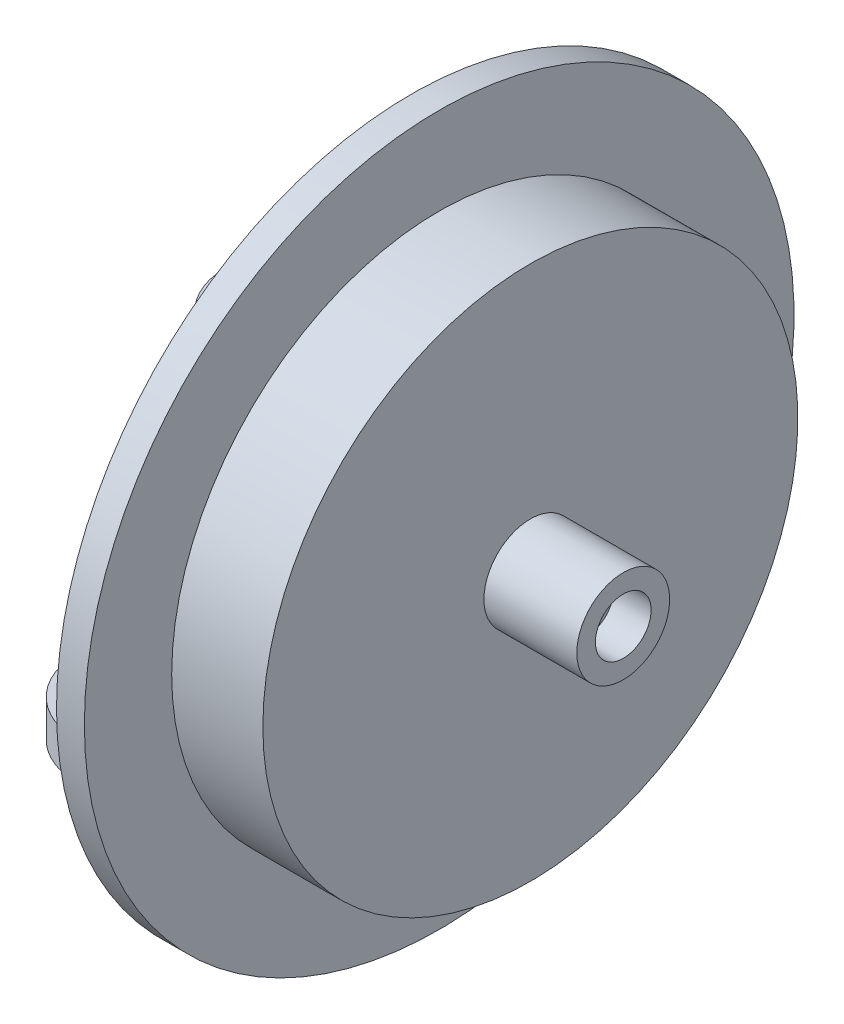
ISO-10303-21;
HEADER;
FILE_DESCRIPTION(('STEP AP214'),'2;1');
FILE_NAME('part.step','',(''),(''),'','','');
FILE_SCHEMA(('AUTOMOTIVE_DESIGN { 1 0 10303 214 1 1 1 1 }'));
ENDSEC;
DATA;
#1=APPLICATION_CONTEXT('core data for automotive mechanical design processes');
#2=APPLICATION_PROTOCOL_DEFINITION('international standard','automotive_design',2000,#1);
#3=PRODUCT_CONTEXT('',#1,'mechanical');
#4=PRODUCT('Part','Part','',(#3));
#5=PRODUCT_RELATED_PRODUCT_CATEGORY('part','',(#4));
#6=PRODUCT_DEFINITION_FORMATION('','',#4);
#7=PRODUCT_DEFINITION_CONTEXT('part definition',#1,'design');
#8=PRODUCT_DEFINITION('design','',#6,#7);
#9=PRODUCT_DEFINITION_SHAPE('','',#8);
#10=(LENGTH_UNIT() NAMED_UNIT(*) SI_UNIT(.MILLI.,.METRE.));
#11=(NAMED_UNIT(*) PLANE_ANGLE_UNIT() SI_UNIT($,.RADIAN.));
#12=(NAMED_UNIT(*) SI_UNIT($,.STERADIAN.) SOLID_ANGLE_UNIT());
#13=UNCERTAINTY_MEASURE_WITH_UNIT(LENGTH_MEASURE(1.E-05),#10,'distance_accuracy_value','');
#14=(GEOMETRIC_REPRESENTATION_CONTEXT(3) GLOBAL_UNCERTAINTY_ASSIGNED_CONTEXT((#13)) GLOBAL_UNIT_ASSIGNED_CONTEXT((#10,
#11,#12)) REPRESENTATION_CONTEXT('',''));
#15=CARTESIAN_POINT('',(0.,0.,0.));
#16=DIRECTION('',(0.,0.,1.));
#17=DIRECTION('',(1.,0.,0.));
#18=AXIS2_PLACEMENT_3D('',#15,#16,#17);
#19=CARTESIAN_POINT('',(-6.4079849746559,0.,-19.1));
#20=DIRECTION('',(1.,0.,0.));
#21=DIRECTION('',(0.,0.,-1.));
#22=AXIS2_PLACEMENT_3D('',#19,#20,#21);
#23=PLANE('',#22);
#24=CARTESIAN_POINT('',(-6.4079849746559,0.,0.));
#25=DIRECTION('',(-1.,0.,0.));
#26=DIRECTION('',(0.,0.,1.));
#27=AXIS2_PLACEMENT_3D('',#24,#25,#26);
#28=CIRCLE('',#27,19.1);
#29=CARTESIAN_POINT('',(-6.4079849746559,0.,19.1));
#30=VERTEX_POINT('',#29);
#31=EDGE_CURVE('E283',#30,#30,#28,.T.);
#32=ORIENTED_EDGE('',*,*,#31,.T.);
#33=EDGE_LOOP('',(#32));
#34=FACE_BOUND('',#33,.T.);
#35=CARTESIAN_POINT('',(-6.4079849746559,0.,0.));
#36=DIRECTION('',(-1.,0.,0.));
#37=DIRECTION('',(0.,0.,1.));
#38=AXIS2_PLACEMENT_3D('',#35,#36,#37);
#39=CIRCLE('',#38,1.);
#40=CARTESIAN_POINT('',(-6.4079849746559,0.,1.));
#41=VERTEX_POINT('',#40);
#42=EDGE_CURVE('E279',#41,#41,#39,.T.);
#43=ORIENTED_EDGE('',*,*,#42,.F.);
#44=EDGE_LOOP('',(#43));
#45=FACE_BOUND('',#44,.T.);
#46=DIRECTION('',(0.,-1.,0.));
#47=VECTOR('',#46,1.);
#48=CARTESIAN_POINT('',(-6.4079849746559,6.,-4.));
#49=LINE('',#48,#47);
#50=CARTESIAN_POINT('',(-6.4079849746559,6.,-4.));
#51=VERTEX_POINT('',#50);
#52=CARTESIAN_POINT('',(-6.4079849746559,4.,-4.));
#53=VERTEX_POINT('',#52);
#54=EDGE_CURVE('E242',#51,#53,#49,.T.);
#55=ORIENTED_EDGE('',*,*,#54,.F.);
#56=DIRECTION('',(0.,0.,-1.));
#57=VECTOR('',#56,1.);
#58=CARTESIAN_POINT('',(-6.4079849746559,6.,-4.));
#59=LINE('',#58,#57);
#60=CARTESIAN_POINT('',(-6.4079849746559,6.,4.));
#61=VERTEX_POINT('',#60);
#62=EDGE_CURVE('E254',#61,#51,#59,.T.);
#63=ORIENTED_EDGE('',*,*,#62,.F.);
#64=DIRECTION('',(0.,1.,0.));
#65=VECTOR('',#64,1.);
#66=CARTESIAN_POINT('',(-6.4079849746559,6.,4.));
#67=LINE('',#66,#65);
#68=CARTESIAN_POINT('',(-6.4079849746559,4.,4.));
#69=VERTEX_POINT('',#68);
#70=EDGE_CURVE('E250',#69,#61,#67,.T.);
#71=ORIENTED_EDGE('',*,*,#70,.F.);
#72=DIRECTION('',(0.,0.,1.));
#73=VECTOR('',#72,1.);
#74=CARTESIAN_POINT('',(-6.4079849746559,4.,-4.));
#75=LINE('',#74,#73);
#76=EDGE_CURVE('E246',#53,#69,#75,.T.);
#77=ORIENTED_EDGE('',*,*,#76,.F.);
#78=EDGE_LOOP('',(#55,#63,#71,#77));
#79=FACE_BOUND('',#78,.T.);
#80=DIRECTION('',(0.,0.,-1.));
#81=VECTOR('',#80,1.);
#82=CARTESIAN_POINT('',(-6.4079849746559,-4.,-4.));
#83=LINE('',#82,#81);
#84=CARTESIAN_POINT('',(-6.4079849746559,-4.,16.));
#85=VERTEX_POINT('',#84);
#86=CARTESIAN_POINT('',(-6.4079849746559,-4.,-4.));
#87=VERTEX_POINT('',#86);
#88=EDGE_CURVE('E232',#85,#87,#83,.T.);
#89=ORIENTED_EDGE('',*,*,#88,.F.);
#90=DIRECTION('',(0.,1.,0.));
#91=VECTOR('',#90,1.);
#92=CARTESIAN_POINT('',(-6.4079849746559,-6.,16.));
#93=LINE('',#92,#91);
#94=CARTESIAN_POINT('',(-6.4079849746559,-6.,16.));
#95=VERTEX_POINT('',#94);
#96=EDGE_CURVE('E208',#95,#85,#93,.T.);
#97=ORIENTED_EDGE('',*,*,#96,.F.);
#98=DIRECTION('',(0.,0.,1.));
#99=VECTOR('',#98,1.);
#100=CARTESIAN_POINT('',(-6.4079849746559,-6.,-4.));
#101=LINE('',#100,#99);
#102=CARTESIAN_POINT('',(-6.4079849746559,-6.,-4.));
#103=VERTEX_POINT('',#102);
#104=EDGE_CURVE('E203',#103,#95,#101,.T.);
#105=ORIENTED_EDGE('',*,*,#104,.F.);
#106=DIRECTION('',(0.,-1.,0.));
#107=VECTOR('',#106,1.);
#108=CARTESIAN_POINT('',(-6.4079849746559,-4.,-4.));
#109=LINE('',#108,#107);
#110=EDGE_CURVE('E226',#87,#103,#109,.T.);
#111=ORIENTED_EDGE('',*,*,#110,.F.);
#112=EDGE_LOOP('',(#89,#97,#105,#111));
#113=FACE_BOUND('',#112,.T.);
#114=ADVANCED_FACE('F39',(#34,#45,#79,#113),#23,.F.);
#115=CARTESIAN_POINT('',(5.,0.,0.));
#116=DIRECTION('',(-1.,0.,0.));
#117=DIRECTION('',(0.,0.,1.));
#118=AXIS2_PLACEMENT_3D('',#115,#116,#117);
#119=CYLINDRICAL_SURFACE('',#118,1.);
#120=ORIENTED_EDGE('',*,*,#42,.T.);
#121=EDGE_LOOP('',(#120));
#122=FACE_BOUND('',#121,.T.);
#123=CARTESIAN_POINT('',(3.,0.,0.));
#124=DIRECTION('',(1.,0.,0.));
#125=DIRECTION('',(0.,0.,-1.));
#126=AXIS2_PLACEMENT_3D('',#123,#124,#125);
#127=CIRCLE('',#126,1.);
#128=CARTESIAN_POINT('',(3.,0.,-1.));
#129=VERTEX_POINT('',#128);
#130=EDGE_CURVE('E275',#129,#129,#127,.F.);
#131=ORIENTED_EDGE('',*,*,#130,.F.);
#132=EDGE_LOOP('',(#131));
#133=FACE_BOUND('',#132,.T.);
#134=ADVANCED_FACE('F360',(#122,#133),#119,.F.);
#135=CARTESIAN_POINT('',(5.,0.,-2.5));
#136=DIRECTION('',(-1.,0.,0.));
#137=DIRECTION('',(0.,0.,1.));
#138=AXIS2_PLACEMENT_3D('',#135,#136,#137);
#139=PLANE('',#138);
#140=CARTESIAN_POINT('',(5.,0.,0.));
#141=DIRECTION('',(1.,0.,0.));
#142=DIRECTION('',(0.,0.,-1.));
#143=AXIS2_PLACEMENT_3D('',#140,#141,#142);
#144=CIRCLE('',#143,1.5);
#145=CARTESIAN_POINT('',(5.,0.,-1.5));
#146=VERTEX_POINT('',#145);
#147=EDGE_CURVE('E270',#146,#146,#144,.T.);
#148=ORIENTED_EDGE('',*,*,#147,.F.);
#149=EDGE_LOOP('',(#148));
#150=FACE_BOUND('',#149,.T.);
#151=CARTESIAN_POINT('',(5.,0.,0.));
#152=DIRECTION('',(-1.,0.,0.));
#153=DIRECTION('',(0.,0.,1.));
#154=AXIS2_PLACEMENT_3D('',#151,#152,#153);
#155=CIRCLE('',#154,2.5);
#156=CARTESIAN_POINT('',(5.,0.,2.5));
#157=VERTEX_POINT('',#156);
#158=EDGE_CURVE('E303',#157,#157,#155,.T.);
#159=ORIENTED_EDGE('',*,*,#158,.F.);
#160=EDGE_LOOP('',(#159));
#161=FACE_BOUND('',#160,.T.);
#162=ADVANCED_FACE('F366',(#150,#161),#139,.F.);
#163=CARTESIAN_POINT('',(-25.5271147425751,0.,0.));
#164=DIRECTION('',(-1.,0.,0.));
#165=DIRECTION('',(0.,0.,1.));
#166=AXIS2_PLACEMENT_3D('',#163,#164,#165);
#167=CYLINDRICAL_SURFACE('',#166,2.5);
#168=CARTESIAN_POINT('',(0.,0.,0.));
#169=DIRECTION('',(-1.,0.,0.));
#170=DIRECTION('',(0.,0.,1.));
#171=AXIS2_PLACEMENT_3D('',#168,#169,#170);
#172=CIRCLE('',#171,2.5);
#173=CARTESIAN_POINT('',(0.,0.,2.5));
#174=VERTEX_POINT('',#173);
#175=EDGE_CURVE('E299',#174,#174,#172,.T.);
#176=ORIENTED_EDGE('',*,*,#175,.F.);
#177=EDGE_LOOP('',(#176));
#178=FACE_BOUND('',#177,.T.);
#179=ORIENTED_EDGE('',*,*,#158,.T.);
#180=EDGE_LOOP('',(#179));
#181=FACE_BOUND('',#180,.T.);
#182=ADVANCED_FACE('F388',(#178,#181),#167,.T.);
#183=CARTESIAN_POINT('',(0.,0.,-2.5));
#184=DIRECTION('',(-1.,0.,0.));
#185=DIRECTION('',(0.,0.,1.));
#186=AXIS2_PLACEMENT_3D('',#183,#184,#185);
#187=PLANE('',#186);
#188=CARTESIAN_POINT('',(0.,0.,0.));
#189=DIRECTION('',(-1.,0.,0.));
#190=DIRECTION('',(0.,0.,1.));
#191=AXIS2_PLACEMENT_3D('',#188,#189,#190);
#192=CIRCLE('',#191,14.4);
#193=CARTESIAN_POINT('',(0.,0.,14.4));
#194=VERTEX_POINT('',#193);
#195=EDGE_CURVE('E295',#194,#194,#192,.T.);
#196=ORIENTED_EDGE('',*,*,#195,.F.);
#197=EDGE_LOOP('',(#196));
#198=FACE_BOUND('',#197,.T.);
#199=ORIENTED_EDGE('',*,*,#175,.T.);
#200=EDGE_LOOP('',(#199));
#201=FACE_BOUND('',#200,.T.);
#202=ADVANCED_FACE('F384',(#198,#201),#187,.F.);
#203=CARTESIAN_POINT('',(-25.5271147425751,0.,0.));
#204=DIRECTION('',(-1.,0.,0.));
#205=DIRECTION('',(0.,0.,1.));
#206=AXIS2_PLACEMENT_3D('',#203,#204,#205);
#207=CYLINDRICAL_SURFACE('',#206,14.4);
#208=CARTESIAN_POINT('',(-4.9079849746559,0.,0.));
#209=DIRECTION('',(-1.,0.,0.));
#210=DIRECTION('',(0.,0.,1.));
#211=AXIS2_PLACEMENT_3D('',#208,#209,#210);
#212=CIRCLE('',#211,14.4);
#213=CARTESIAN_POINT('',(-4.9079849746559,0.,14.4));
#214=VERTEX_POINT('',#213);
#215=EDGE_CURVE('E291',#214,#214,#212,.T.);
#216=ORIENTED_EDGE('',*,*,#215,.F.);
#217=EDGE_LOOP('',(#216));
#218=FACE_BOUND('',#217,.T.);
#219=ORIENTED_EDGE('',*,*,#195,.T.);
#220=EDGE_LOOP('',(#219));
#221=FACE_BOUND('',#220,.T.);
#222=ADVANCED_FACE('F380',(#218,#221),#207,.T.);
#223=CARTESIAN_POINT('',(-4.9079849746559,0.,-14.4));
#224=DIRECTION('',(-1.,0.,0.));
#225=DIRECTION('',(0.,0.,1.));
#226=AXIS2_PLACEMENT_3D('',#223,#224,#225);
#227=PLANE('',#226);
#228=CARTESIAN_POINT('',(-4.9079849746559,0.,0.));
#229=DIRECTION('',(-1.,0.,0.));
#230=DIRECTION('',(0.,0.,1.));
#231=AXIS2_PLACEMENT_3D('',#228,#229,#230);
#232=CIRCLE('',#231,19.1);
#233=CARTESIAN_POINT('',(-4.9079849746559,0.,19.1));
#234=VERTEX_POINT('',#233);
#235=EDGE_CURVE('E287',#234,#234,#232,.T.);
#236=ORIENTED_EDGE('',*,*,#235,.F.);
#237=EDGE_LOOP('',(#236));
#238=FACE_BOUND('',#237,.T.);
#239=ORIENTED_EDGE('',*,*,#215,.T.);
#240=EDGE_LOOP('',(#239));
#241=FACE_BOUND('',#240,.T.);
#242=ADVANCED_FACE('F376',(#238,#241),#227,.F.);
#243=CARTESIAN_POINT('',(-25.5271147425751,0.,0.));
#244=DIRECTION('',(-1.,0.,0.));
#245=DIRECTION('',(0.,0.,1.));
#246=AXIS2_PLACEMENT_3D('',#243,#244,#245);
#247=CYLINDRICAL_SURFACE('',#246,19.1);
#248=ORIENTED_EDGE('',*,*,#31,.F.);
#249=EDGE_LOOP('',(#248));
#250=FACE_BOUND('',#249,.T.);
#251=ORIENTED_EDGE('',*,*,#235,.T.);
#252=EDGE_LOOP('',(#251));
#253=FACE_BOUND('',#252,.T.);
#254=ADVANCED_FACE('F372',(#250,#253),#247,.T.);
#255=CARTESIAN_POINT('',(3.,0.,0.));
#256=DIRECTION('',(1.,0.,0.));
#257=DIRECTION('',(0.,0.,-1.));
#258=AXIS2_PLACEMENT_3D('',#255,#256,#257);
#259=PLANE('',#258);
#260=CARTESIAN_POINT('',(3.,0.,0.));
#261=DIRECTION('',(1.,0.,0.));
#262=DIRECTION('',(0.,0.,-1.));
#263=AXIS2_PLACEMENT_3D('',#260,#261,#262);
#264=CIRCLE('',#263,1.5);
#265=CARTESIAN_POINT('',(3.,0.,-1.5));
#266=VERTEX_POINT('',#265);
#267=EDGE_CURVE('E271',#266,#266,#264,.T.);
#268=ORIENTED_EDGE('',*,*,#267,.T.);
#269=EDGE_LOOP('',(#268));
#270=FACE_BOUND('',#269,.T.);
#271=ORIENTED_EDGE('',*,*,#130,.T.);
#272=EDGE_LOOP('',(#271));
#273=FACE_BOUND('',#272,.T.);
#274=ADVANCED_FACE('F375',(#270,#273),#259,.T.);
#275=CARTESIAN_POINT('',(3.,0.,0.));
#276=DIRECTION('',(1.,0.,0.));
#277=DIRECTION('',(0.,0.,-1.));
#278=AXIS2_PLACEMENT_3D('',#275,#276,#277);
#279=CYLINDRICAL_SURFACE('',#278,1.5);
#280=ORIENTED_EDGE('',*,*,#267,.F.);
#281=EDGE_LOOP('',(#280));
#282=FACE_BOUND('',#281,.T.);
#283=ORIENTED_EDGE('',*,*,#147,.T.);
#284=EDGE_LOOP('',(#283));
#285=FACE_BOUND('',#284,.T.);
#286=ADVANCED_FACE('F438',(#282,#285),#279,.F.);
#287=CARTESIAN_POINT('',(-16.4079849746559,6.,-4.));
#288=DIRECTION('',(0.,0.,1.));
#289=DIRECTION('',(1.,0.,0.));
#290=AXIS2_PLACEMENT_3D('',#287,#288,#289);
#291=PLANE('',#290);
#292=DIRECTION('',(1.,0.,0.));
#293=VECTOR('',#292,1.);
#294=CARTESIAN_POINT('',(-16.4079849746559,4.,-4.));
#295=LINE('',#294,#293);
#296=CARTESIAN_POINT('',(-12.4079849746559,4.,-4.));
#297=VERTEX_POINT('',#296);
#298=EDGE_CURVE('E267',#297,#53,#295,.T.);
#299=ORIENTED_EDGE('',*,*,#298,.F.);
#300=DIRECTION('',(0.,-1.,0.));
#301=VECTOR('',#300,1.);
#302=CARTESIAN_POINT('',(-12.4079849746559,6.,-4.));
#303=LINE('',#302,#301);
#304=CARTESIAN_POINT('',(-12.4079849746559,6.,-4.));
#305=VERTEX_POINT('',#304);
#306=EDGE_CURVE('E176',#297,#305,#303,.F.);
#307=ORIENTED_EDGE('',*,*,#306,.T.);
#308=DIRECTION('',(1.,0.,0.));
#309=VECTOR('',#308,1.);
#310=CARTESIAN_POINT('',(-16.4079849746559,6.,-4.));
#311=LINE('',#310,#309);
#312=EDGE_CURVE('E258',#305,#51,#311,.T.);
#313=ORIENTED_EDGE('',*,*,#312,.T.);
#314=ORIENTED_EDGE('',*,*,#54,.T.);
#315=EDGE_LOOP('',(#299,#307,#313,#314));
#316=FACE_BOUND('',#315,.T.);
#317=ADVANCED_FACE('F415',(#316),#291,.F.);
#318=CARTESIAN_POINT('',(-16.4079849746559,4.,-4.));
#319=DIRECTION('',(0.,1.,0.));
#320=DIRECTION('',(0.,0.,1.));
#321=AXIS2_PLACEMENT_3D('',#318,#319,#320);
#322=PLANE('',#321);
#323=CARTESIAN_POINT('',(-11.4079849746559,4.,0.));
#324=DIRECTION('',(0.,1.,0.));
#325=DIRECTION('',(0.,0.,1.));
#326=AXIS2_PLACEMENT_3D('',#323,#324,#325);
#327=CIRCLE('',#326,1.25);
#328=CARTESIAN_POINT('',(-11.4079849746559,4.,1.25));
#329=VERTEX_POINT('',#328);
#330=EDGE_CURVE('E222',#329,#329,#327,.T.);
#331=ORIENTED_EDGE('',*,*,#330,.T.);
#332=EDGE_LOOP('',(#331));
#333=FACE_BOUND('',#332,.T.);
#334=DIRECTION('',(1.,0.,0.));
#335=VECTOR('',#334,1.);
#336=CARTESIAN_POINT('',(-16.4079849746559,4.,4.));
#337=LINE('',#336,#335);
#338=CARTESIAN_POINT('',(-12.4079849746559,4.,4.));
#339=VERTEX_POINT('',#338);
#340=EDGE_CURVE('E264',#339,#69,#337,.T.);
#341=ORIENTED_EDGE('',*,*,#340,.F.);
#342=CARTESIAN_POINT('',(-12.4079849746559,4.,0.));
#343=DIRECTION('',(0.,1.,0.));
#344=DIRECTION('',(0.,0.,1.));
#345=AXIS2_PLACEMENT_3D('',#342,#343,#344);
#346=CIRCLE('',#345,4.);
#347=CARTESIAN_POINT('',(-16.4079849746559,4.,0.));
#348=VERTEX_POINT('',#347);
#349=EDGE_CURVE('E173',#339,#348,#346,.F.);
#350=ORIENTED_EDGE('',*,*,#349,.T.);
#351=CARTESIAN_POINT('',(-12.4079849746559,4.,0.));
#352=DIRECTION('',(0.,1.,0.));
#353=DIRECTION('',(0.,0.,1.));
#354=AXIS2_PLACEMENT_3D('',#351,#352,#353);
#355=CIRCLE('',#354,4.);
#356=EDGE_CURVE('E170',#348,#297,#355,.F.);
#357=ORIENTED_EDGE('',*,*,#356,.T.);
#358=ORIENTED_EDGE('',*,*,#298,.T.);
#359=ORIENTED_EDGE('',*,*,#76,.T.);
#360=EDGE_LOOP('',(#341,#350,#357,#358,#359));
#361=FACE_BOUND('',#360,.T.);
#362=ADVANCED_FACE('F428',(#333,#361),#322,.F.);
#363=CARTESIAN_POINT('',(-16.4079849746559,6.,4.));
#364=DIRECTION('',(0.,0.,-1.));
#365=DIRECTION('',(0.,1.,0.));
#366=AXIS2_PLACEMENT_3D('',#363,#364,#365);
#367=PLANE('',#366);
#368=DIRECTION('',(1.,0.,0.));
#369=VECTOR('',#368,1.);
#370=CARTESIAN_POINT('',(-16.4079849746559,6.,4.));
#371=LINE('',#370,#369);
#372=CARTESIAN_POINT('',(-12.4079849746559,6.,4.));
#373=VERTEX_POINT('',#372);
#374=EDGE_CURVE('E261',#373,#61,#371,.T.);
#375=ORIENTED_EDGE('',*,*,#374,.F.);
#376=DIRECTION('',(0.,1.,0.));
#377=VECTOR('',#376,1.);
#378=CARTESIAN_POINT('',(-12.4079849746559,4.,4.));
#379=LINE('',#378,#377);
#380=EDGE_CURVE('E166',#373,#339,#379,.F.);
#381=ORIENTED_EDGE('',*,*,#380,.T.);
#382=ORIENTED_EDGE('',*,*,#340,.T.);
#383=ORIENTED_EDGE('',*,*,#70,.T.);
#384=EDGE_LOOP('',(#375,#381,#382,#383));
#385=FACE_BOUND('',#384,.T.);
#386=ADVANCED_FACE('F424',(#385),#367,.F.);
#387=CARTESIAN_POINT('',(-16.4079849746559,6.,-4.));
#388=DIRECTION('',(0.,-1.,0.));
#389=DIRECTION('',(0.,0.,-1.));
#390=AXIS2_PLACEMENT_3D('',#387,#388,#389);
#391=PLANE('',#390);
#392=CARTESIAN_POINT('',(-11.4079849746559,6.,0.));
#393=DIRECTION('',(0.,1.,0.));
#394=DIRECTION('',(0.,0.,1.));
#395=AXIS2_PLACEMENT_3D('',#392,#393,#394);
#396=CIRCLE('',#395,1.25);
#397=CARTESIAN_POINT('',(-11.4079849746559,6.,1.25));
#398=VERTEX_POINT('',#397);
#399=EDGE_CURVE('E182',#398,#398,#396,.T.);
#400=ORIENTED_EDGE('',*,*,#399,.F.);
#401=EDGE_LOOP('',(#400));
#402=FACE_BOUND('',#401,.T.);
#403=CARTESIAN_POINT('',(-12.4079849746559,6.,0.));
#404=DIRECTION('',(0.,-1.,0.));
#405=DIRECTION('',(0.,0.,-1.));
#406=AXIS2_PLACEMENT_3D('',#403,#404,#405);
#407=CIRCLE('',#406,4.);
#408=CARTESIAN_POINT('',(-16.4079849746559,6.,0.));
#409=VERTEX_POINT('',#408);
#410=EDGE_CURVE('E160',#305,#409,#407,.F.);
#411=ORIENTED_EDGE('',*,*,#410,.T.);
#412=CARTESIAN_POINT('',(-12.4079849746559,6.,0.));
#413=DIRECTION('',(0.,-1.,0.));
#414=DIRECTION('',(0.,0.,-1.));
#415=AXIS2_PLACEMENT_3D('',#412,#413,#414);
#416=CIRCLE('',#415,4.);
#417=EDGE_CURVE('E163',#409,#373,#416,.F.);
#418=ORIENTED_EDGE('',*,*,#417,.T.);
#419=ORIENTED_EDGE('',*,*,#374,.T.);
#420=ORIENTED_EDGE('',*,*,#62,.T.);
#421=ORIENTED_EDGE('',*,*,#312,.F.);
#422=EDGE_LOOP('',(#411,#418,#419,#420,#421));
#423=FACE_BOUND('',#422,.T.);
#424=ADVANCED_FACE('F357',(#402,#423),#391,.F.);
#425=CARTESIAN_POINT('',(-16.4079849746559,-4.,-4.));
#426=DIRECTION('',(0.,0.,1.));
#427=DIRECTION('',(1.,0.,0.));
#428=AXIS2_PLACEMENT_3D('',#425,#426,#427);
#429=PLANE('',#428);
#430=DIRECTION('',(1.,0.,0.));
#431=VECTOR('',#430,1.);
#432=CARTESIAN_POINT('',(-16.4079849746559,-6.,-4.));
#433=LINE('',#432,#431);
#434=CARTESIAN_POINT('',(-12.4079849746559,-6.,-4.));
#435=VERTEX_POINT('',#434);
#436=EDGE_CURVE('E239',#435,#103,#433,.T.);
#437=ORIENTED_EDGE('',*,*,#436,.F.);
#438=DIRECTION('',(0.,-1.,0.));
#439=VECTOR('',#438,1.);
#440=CARTESIAN_POINT('',(-12.4079849746559,-4.,-4.));
#441=LINE('',#440,#439);
#442=CARTESIAN_POINT('',(-12.4079849746559,-4.,-4.));
#443=VERTEX_POINT('',#442);
#444=EDGE_CURVE('E143',#435,#443,#441,.F.);
#445=ORIENTED_EDGE('',*,*,#444,.T.);
#446=DIRECTION('',(1.,0.,0.));
#447=VECTOR('',#446,1.);
#448=CARTESIAN_POINT('',(-16.4079849746559,-4.,-4.));
#449=LINE('',#448,#447);
#450=EDGE_CURVE('E236',#443,#87,#449,.T.);
#451=ORIENTED_EDGE('',*,*,#450,.T.);
#452=ORIENTED_EDGE('',*,*,#110,.T.);
#453=EDGE_LOOP('',(#437,#445,#451,#452));
#454=FACE_BOUND('',#453,.T.);
#455=ADVANCED_FACE('F322',(#454),#429,.F.);
#456=CARTESIAN_POINT('',(-16.4079849746559,-6.,-4.));
#457=DIRECTION('',(0.,1.,0.));
#458=DIRECTION('',(0.,0.,1.));
#459=AXIS2_PLACEMENT_3D('',#456,#457,#458);
#460=PLANE('',#459);
#461=CARTESIAN_POINT('',(-9.4079849746559,-6.,13.));
#462=DIRECTION('',(0.,1.,0.));
#463=DIRECTION('',(0.,0.,1.));
#464=AXIS2_PLACEMENT_3D('',#461,#462,#463);
#465=CIRCLE('',#464,1.25);
#466=CARTESIAN_POINT('',(-9.4079849746559,-6.,14.25));
#467=VERTEX_POINT('',#466);
#468=EDGE_CURVE('E326',#467,#467,#465,.T.);
#469=ORIENTED_EDGE('',*,*,#468,.T.);
#470=EDGE_LOOP('',(#469));
#471=FACE_BOUND('',#470,.T.);
#472=CARTESIAN_POINT('',(-11.4079849746559,-6.,0.));
#473=DIRECTION('',(0.,1.,0.));
#474=DIRECTION('',(0.,0.,1.));
#475=AXIS2_PLACEMENT_3D('',#472,#473,#474);
#476=CIRCLE('',#475,1.25);
#477=CARTESIAN_POINT('',(-11.4079849746559,-6.,1.25));
#478=VERTEX_POINT('',#477);
#479=EDGE_CURVE('E218',#478,#478,#476,.T.);
#480=ORIENTED_EDGE('',*,*,#479,.T.);
#481=EDGE_LOOP('',(#480));
#482=FACE_BOUND('',#481,.T.);
#483=DIRECTION('',(1.,0.,0.));
#484=VECTOR('',#483,1.);
#485=CARTESIAN_POINT('',(-12.4079849746559,-6.,16.));
#486=LINE('',#485,#484);
#487=CARTESIAN_POINT('',(-8.4079849746559,-6.,16.));
#488=VERTEX_POINT('',#487);
#489=EDGE_CURVE('E132',#488,#95,#486,.T.);
#490=ORIENTED_EDGE('',*,*,#489,.F.);
#491=CARTESIAN_POINT('',(-8.4079849746559,-6.,12.));
#492=DIRECTION('',(0.,1.,0.));
#493=DIRECTION('',(0.,0.,1.));
#494=AXIS2_PLACEMENT_3D('',#491,#492,#493);
#495=CIRCLE('',#494,4.);
#496=CARTESIAN_POINT('',(-12.4079849746559,-6.,12.));
#497=VERTEX_POINT('',#496);
#498=EDGE_CURVE('E62',#488,#497,#495,.F.);
#499=ORIENTED_EDGE('',*,*,#498,.T.);
#500=DIRECTION('',(0.,0.,-1.));
#501=VECTOR('',#500,1.);
#502=CARTESIAN_POINT('',(-12.4079849746559,-6.,16.));
#503=LINE('',#502,#501);
#504=CARTESIAN_POINT('',(-12.4079849746559,-6.,4.00000000000001));
#505=VERTEX_POINT('',#504);
#506=EDGE_CURVE('E124',#497,#505,#503,.T.);
#507=ORIENTED_EDGE('',*,*,#506,.T.);
#508=CARTESIAN_POINT('',(-12.4079849746559,-6.,0.));
#509=DIRECTION('',(0.,1.,0.));
#510=DIRECTION('',(0.,0.,1.));
#511=AXIS2_PLACEMENT_3D('',#508,#509,#510);
#512=CIRCLE('',#511,4.);
#513=CARTESIAN_POINT('',(-16.4079849746559,-6.,0.));
#514=VERTEX_POINT('',#513);
#515=EDGE_CURVE('E127',#505,#514,#512,.F.);
#516=ORIENTED_EDGE('',*,*,#515,.T.);
#517=CARTESIAN_POINT('',(-12.4079849746559,-6.,0.));
#518=DIRECTION('',(0.,1.,0.));
#519=DIRECTION('',(0.,0.,1.));
#520=AXIS2_PLACEMENT_3D('',#517,#518,#519);
#521=CIRCLE('',#520,4.);
#522=EDGE_CURVE('E144',#514,#435,#521,.F.);
#523=ORIENTED_EDGE('',*,*,#522,.T.);
#524=ORIENTED_EDGE('',*,*,#436,.T.);
#525=ORIENTED_EDGE('',*,*,#104,.T.);
#526=EDGE_LOOP('',(#490,#499,#507,#516,#523,#524,#525));
#527=FACE_BOUND('',#526,.T.);
#528=ADVANCED_FACE('F126',(#471,#482,#527),#460,.F.);
#529=CARTESIAN_POINT('',(-16.4079849746559,-4.,-4.));
#530=DIRECTION('',(0.,-1.,0.));
#531=DIRECTION('',(0.,0.,-1.));
#532=AXIS2_PLACEMENT_3D('',#529,#530,#531);
#533=PLANE('',#532);
#534=CARTESIAN_POINT('',(-9.4079849746559,-4.,13.));
#535=DIRECTION('',(0.,1.,0.));
#536=DIRECTION('',(0.,0.,1.));
#537=AXIS2_PLACEMENT_3D('',#534,#535,#536);
#538=CIRCLE('',#537,1.25);
#539=CARTESIAN_POINT('',(-9.4079849746559,-4.,14.25));
#540=VERTEX_POINT('',#539);
#541=EDGE_CURVE('E329',#540,#540,#538,.T.);
#542=ORIENTED_EDGE('',*,*,#541,.F.);
#543=EDGE_LOOP('',(#542));
#544=FACE_BOUND('',#543,.T.);
#545=CARTESIAN_POINT('',(-11.4079849746559,-4.,0.));
#546=DIRECTION('',(0.,-1.,0.));
#547=DIRECTION('',(0.,0.,-1.));
#548=AXIS2_PLACEMENT_3D('',#545,#546,#547);
#549=CIRCLE('',#548,1.25);
#550=CARTESIAN_POINT('',(-11.4079849746559,-4.,-1.25));
#551=VERTEX_POINT('',#550);
#552=EDGE_CURVE('E217',#551,#551,#549,.T.);
#553=ORIENTED_EDGE('',*,*,#552,.T.);
#554=EDGE_LOOP('',(#553));
#555=FACE_BOUND('',#554,.T.);
#556=DIRECTION('',(0.,0.,-1.));
#557=VECTOR('',#556,1.);
#558=CARTESIAN_POINT('',(-12.4079849746559,-4.,16.));
#559=LINE('',#558,#557);
#560=CARTESIAN_POINT('',(-12.4079849746559,-4.,12.));
#561=VERTEX_POINT('',#560);
#562=CARTESIAN_POINT('',(-12.4079849746559,-4.,4.));
#563=VERTEX_POINT('',#562);
#564=EDGE_CURVE('E131',#561,#563,#559,.T.);
#565=ORIENTED_EDGE('',*,*,#564,.F.);
#566=CARTESIAN_POINT('',(-8.4079849746559,-4.,12.));
#567=DIRECTION('',(0.,-1.,0.));
#568=DIRECTION('',(0.,0.,-1.));
#569=AXIS2_PLACEMENT_3D('',#566,#567,#568);
#570=CIRCLE('',#569,4.);
#571=CARTESIAN_POINT('',(-8.4079849746559,-4.,16.));
#572=VERTEX_POINT('',#571);
#573=EDGE_CURVE('E11',#561,#572,#570,.F.);
#574=ORIENTED_EDGE('',*,*,#573,.T.);
#575=DIRECTION('',(-1.,0.,0.));
#576=VECTOR('',#575,1.);
#577=CARTESIAN_POINT('',(-6.4079849746559,-4.,16.));
#578=LINE('',#577,#576);
#579=EDGE_CURVE('E199',#85,#572,#578,.T.);
#580=ORIENTED_EDGE('',*,*,#579,.F.);
#581=ORIENTED_EDGE('',*,*,#88,.T.);
#582=ORIENTED_EDGE('',*,*,#450,.F.);
#583=CARTESIAN_POINT('',(-12.4079849746559,-4.,0.));
#584=DIRECTION('',(0.,-1.,0.));
#585=DIRECTION('',(0.,0.,-1.));
#586=AXIS2_PLACEMENT_3D('',#583,#584,#585);
#587=CIRCLE('',#586,4.);
#588=CARTESIAN_POINT('',(-16.4079849746559,-4.,0.));
#589=VERTEX_POINT('',#588);
#590=EDGE_CURVE('E154',#443,#589,#587,.F.);
#591=ORIENTED_EDGE('',*,*,#590,.T.);
#592=CARTESIAN_POINT('',(-12.4079849746559,-4.,0.));
#593=DIRECTION('',(0.,-1.,0.));
#594=DIRECTION('',(0.,0.,-1.));
#595=AXIS2_PLACEMENT_3D('',#592,#593,#594);
#596=CIRCLE('',#595,4.);
#597=EDGE_CURVE('E149',#589,#563,#596,.F.);
#598=ORIENTED_EDGE('',*,*,#597,.T.);
#599=EDGE_LOOP('',(#565,#574,#580,#581,#582,#591,#598));
#600=FACE_BOUND('',#599,.T.);
#601=ADVANCED_FACE('F316',(#544,#555,#600),#533,.F.);
#602=CARTESIAN_POINT('',(-11.4079849746559,-14.,0.));
#603=DIRECTION('',(0.,1.,0.));
#604=DIRECTION('',(0.,0.,1.));
#605=AXIS2_PLACEMENT_3D('',#602,#603,#604);
#606=CYLINDRICAL_SURFACE('',#605,1.25);
#607=ORIENTED_EDGE('',*,*,#552,.F.);
#608=EDGE_LOOP('',(#607));
#609=FACE_BOUND('',#608,.T.);
#610=ORIENTED_EDGE('',*,*,#479,.F.);
#611=EDGE_LOOP('',(#610));
#612=FACE_BOUND('',#611,.T.);
#613=ADVANCED_FACE('F341',(#609,#612),#606,.F.);
#614=ORIENTED_EDGE('',*,*,#399,.T.);
#615=EDGE_LOOP('',(#614));
#616=FACE_BOUND('',#615,.T.);
#617=ORIENTED_EDGE('',*,*,#330,.F.);
#618=EDGE_LOOP('',(#617));
#619=FACE_BOUND('',#618,.T.);
#620=ADVANCED_FACE('F347',(#616,#619),#606,.F.);
#621=CARTESIAN_POINT('',(-12.4079849746559,0.,0.));
#622=DIRECTION('',(0.,1.,0.));
#623=DIRECTION('',(0.,0.,1.));
#624=AXIS2_PLACEMENT_3D('',#621,#622,#623);
#625=CYLINDRICAL_SURFACE('',#624,4.);
#626=ORIENTED_EDGE('',*,*,#444,.F.);
#627=ORIENTED_EDGE('',*,*,#522,.F.);
#628=DIRECTION('',(0.,-1.,0.));
#629=VECTOR('',#628,1.);
#630=CARTESIAN_POINT('',(-16.4079849746559,-6.,0.));
#631=LINE('',#630,#629);
#632=EDGE_CURVE('E141',#589,#514,#631,.T.);
#633=ORIENTED_EDGE('',*,*,#632,.F.);
#634=ORIENTED_EDGE('',*,*,#590,.F.);
#635=EDGE_LOOP('',(#626,#627,#633,#634));
#636=FACE_BOUND('',#635,.T.);
#637=ADVANCED_FACE('F319',(#636),#625,.T.);
#638=CARTESIAN_POINT('',(-12.4079849746559,0.,0.));
#639=DIRECTION('',(0.,-1.,0.));
#640=DIRECTION('',(0.,0.,-1.));
#641=AXIS2_PLACEMENT_3D('',#638,#639,#640);
#642=CYLINDRICAL_SURFACE('',#641,4.);
#643=ORIENTED_EDGE('',*,*,#515,.F.);
#644=DIRECTION('',(0.,1.,0.));
#645=VECTOR('',#644,1.);
#646=CARTESIAN_POINT('',(-12.4079849746559,-6.,4.));
#647=LINE('',#646,#645);
#648=EDGE_CURVE('E139',#563,#505,#647,.F.);
#649=ORIENTED_EDGE('',*,*,#648,.F.);
#650=ORIENTED_EDGE('',*,*,#597,.F.);
#651=ORIENTED_EDGE('',*,*,#632,.T.);
#652=EDGE_LOOP('',(#643,#649,#650,#651));
#653=FACE_BOUND('',#652,.T.);
#654=ADVANCED_FACE('F137',(#653),#642,.T.);
#655=CARTESIAN_POINT('',(-12.4079849746559,0.,0.));
#656=DIRECTION('',(0.,1.,0.));
#657=DIRECTION('',(0.,0.,1.));
#658=AXIS2_PLACEMENT_3D('',#655,#656,#657);
#659=CYLINDRICAL_SURFACE('',#658,4.);
#660=ORIENTED_EDGE('',*,*,#306,.F.);
#661=ORIENTED_EDGE('',*,*,#356,.F.);
#662=DIRECTION('',(0.,-1.,0.));
#663=VECTOR('',#662,1.);
#664=CARTESIAN_POINT('',(-16.4079849746559,4.,0.));
#665=LINE('',#664,#663);
#666=EDGE_CURVE('E183',#409,#348,#665,.T.);
#667=ORIENTED_EDGE('',*,*,#666,.F.);
#668=ORIENTED_EDGE('',*,*,#410,.F.);
#669=EDGE_LOOP('',(#660,#661,#667,#668));
#670=FACE_BOUND('',#669,.T.);
#671=ADVANCED_FACE('F398',(#670),#659,.T.);
#672=CARTESIAN_POINT('',(-12.4079849746559,0.,0.));
#673=DIRECTION('',(0.,-1.,0.));
#674=DIRECTION('',(0.,0.,-1.));
#675=AXIS2_PLACEMENT_3D('',#672,#673,#674);
#676=CYLINDRICAL_SURFACE('',#675,4.);
#677=ORIENTED_EDGE('',*,*,#349,.F.);
#678=ORIENTED_EDGE('',*,*,#380,.F.);
#679=ORIENTED_EDGE('',*,*,#417,.F.);
#680=ORIENTED_EDGE('',*,*,#666,.T.);
#681=EDGE_LOOP('',(#677,#678,#679,#680));
#682=FACE_BOUND('',#681,.T.);
#683=ADVANCED_FACE('F401',(#682),#676,.T.);
#684=CARTESIAN_POINT('',(-12.4079849746559,-4.,16.));
#685=DIRECTION('',(1.,0.,0.));
#686=DIRECTION('',(0.,0.,-1.));
#687=AXIS2_PLACEMENT_3D('',#684,#685,#686);
#688=PLANE('',#687);
#689=ORIENTED_EDGE('',*,*,#506,.F.);
#690=DIRECTION('',(0.,-1.,0.));
#691=VECTOR('',#690,1.);
#692=CARTESIAN_POINT('',(-12.4079849746559,-4.,12.));
#693=LINE('',#692,#691);
#694=EDGE_CURVE('E48',#497,#561,#693,.F.);
#695=ORIENTED_EDGE('',*,*,#694,.T.);
#696=ORIENTED_EDGE('',*,*,#564,.T.);
#697=ORIENTED_EDGE('',*,*,#648,.T.);
#698=EDGE_LOOP('',(#689,#695,#696,#697));
#699=FACE_BOUND('',#698,.T.);
#700=ADVANCED_FACE('F146',(#699),#688,.F.);
#701=CARTESIAN_POINT('',(0.,0.,16.));
#702=DIRECTION('',(0.,0.,1.));
#703=DIRECTION('',(1.,0.,0.));
#704=AXIS2_PLACEMENT_3D('',#701,#702,#703);
#705=PLANE('',#704);
#706=ORIENTED_EDGE('',*,*,#579,.T.);
#707=DIRECTION('',(0.,-1.,0.));
#708=VECTOR('',#707,1.);
#709=CARTESIAN_POINT('',(-8.4079849746559,-6.,16.));
#710=LINE('',#709,#708);
#711=EDGE_CURVE('E179',#572,#488,#710,.T.);
#712=ORIENTED_EDGE('',*,*,#711,.T.);
#713=ORIENTED_EDGE('',*,*,#489,.T.);
#714=ORIENTED_EDGE('',*,*,#96,.T.);
#715=EDGE_LOOP('',(#706,#712,#713,#714));
#716=FACE_BOUND('',#715,.T.);
#717=ADVANCED_FACE('F195',(#716),#705,.T.);
#718=CARTESIAN_POINT('',(-9.4079849746559,-16.,13.));
#719=DIRECTION('',(0.,1.,0.));
#720=DIRECTION('',(0.,0.,1.));
#721=AXIS2_PLACEMENT_3D('',#718,#719,#720);
#722=CYLINDRICAL_SURFACE('',#721,1.25);
#723=ORIENTED_EDGE('',*,*,#541,.T.);
#724=EDGE_LOOP('',(#723));
#725=FACE_BOUND('',#724,.T.);
#726=ORIENTED_EDGE('',*,*,#468,.F.);
#727=EDGE_LOOP('',(#726));
#728=FACE_BOUND('',#727,.T.);
#729=ADVANCED_FACE('F336',(#725,#728),#722,.F.);
#730=CARTESIAN_POINT('',(-8.4079849746559,0.,12.));
#731=DIRECTION('',(0.,1.,0.));
#732=DIRECTION('',(0.,0.,1.));
#733=AXIS2_PLACEMENT_3D('',#730,#731,#732);
#734=CYLINDRICAL_SURFACE('',#733,4.);
#735=ORIENTED_EDGE('',*,*,#573,.F.);
#736=ORIENTED_EDGE('',*,*,#694,.F.);
#737=ORIENTED_EDGE('',*,*,#498,.F.);
#738=ORIENTED_EDGE('',*,*,#711,.F.);
#739=EDGE_LOOP('',(#735,#736,#737,#738));
#740=FACE_BOUND('',#739,.T.);
#741=ADVANCED_FACE('F41',(#740),#734,.T.);
#742=CLOSED_SHELL('',(#114,#134,#162,#182,#202,#222,#242,#254,#274,#286,#317,#362,#386,#424,
#455,#528,#601,#613,#620,#637,#654,#671,#683,#700,#717,#729,#741));
#743=MANIFOLD_SOLID_BREP('B2',#742);
#744=ADVANCED_BREP_SHAPE_REPRESENTATION('',(#18,#743),#14);
#745=SHAPE_DEFINITION_REPRESENTATION(#9,#744);
ENDSEC;
END-ISO-10303-21;
